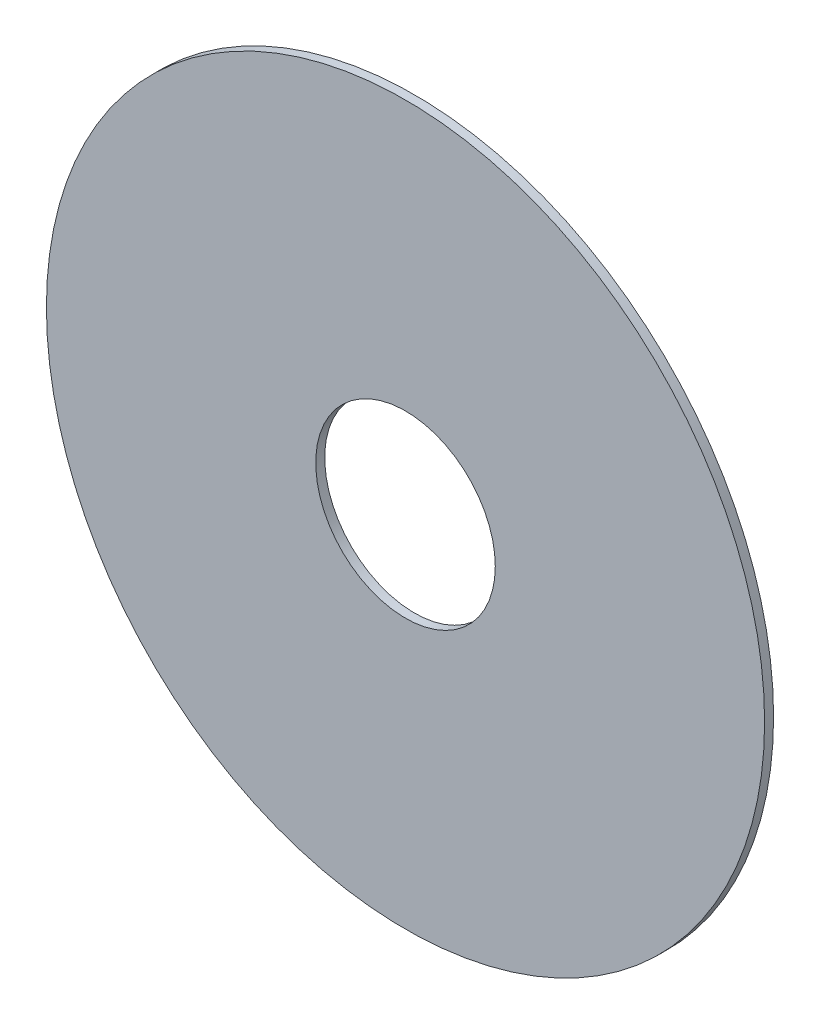
ISO-10303-21;
HEADER;
FILE_DESCRIPTION(('STEP AP214'),'2;1');
FILE_NAME('part.step','',(''),(''),'','','');
FILE_SCHEMA(('AUTOMOTIVE_DESIGN { 1 0 10303 214 1 1 1 1 }'));
ENDSEC;
DATA;
#1=APPLICATION_CONTEXT('core data for automotive mechanical design processes');
#2=APPLICATION_PROTOCOL_DEFINITION('international standard','automotive_design',2000,#1);
#3=PRODUCT_CONTEXT('',#1,'mechanical');
#4=PRODUCT('Part','Part','',(#3));
#5=PRODUCT_RELATED_PRODUCT_CATEGORY('part','',(#4));
#6=PRODUCT_DEFINITION_FORMATION('','',#4);
#7=PRODUCT_DEFINITION_CONTEXT('part definition',#1,'design');
#8=PRODUCT_DEFINITION('design','',#6,#7);
#9=PRODUCT_DEFINITION_SHAPE('','',#8);
#10=(LENGTH_UNIT() NAMED_UNIT(*) SI_UNIT(.MILLI.,.METRE.));
#11=(NAMED_UNIT(*) PLANE_ANGLE_UNIT() SI_UNIT($,.RADIAN.));
#12=(NAMED_UNIT(*) SI_UNIT($,.STERADIAN.) SOLID_ANGLE_UNIT());
#13=UNCERTAINTY_MEASURE_WITH_UNIT(LENGTH_MEASURE(1.E-05),#10,'distance_accuracy_value','');
#14=(GEOMETRIC_REPRESENTATION_CONTEXT(3) GLOBAL_UNCERTAINTY_ASSIGNED_CONTEXT((#13)) GLOBAL_UNIT_ASSIGNED_CONTEXT((#10,
#11,#12)) REPRESENTATION_CONTEXT('',''));
#15=CARTESIAN_POINT('',(0.,0.,0.));
#16=DIRECTION('',(0.,0.,1.));
#17=DIRECTION('',(1.,0.,0.));
#18=AXIS2_PLACEMENT_3D('',#15,#16,#17);
#19=CARTESIAN_POINT('',(0.,0.,0.5));
#20=DIRECTION('',(0.,0.,1.));
#21=DIRECTION('',(1.,0.,0.));
#22=AXIS2_PLACEMENT_3D('',#19,#20,#21);
#23=PLANE('',#22);
#24=CARTESIAN_POINT('',(0.,0.,0.5));
#25=DIRECTION('',(0.,0.,1.));
#26=DIRECTION('',(1.,0.,0.));
#27=AXIS2_PLACEMENT_3D('',#24,#25,#26);
#28=CIRCLE('',#27,5.);
#29=CARTESIAN_POINT('',(5.,0.,0.5));
#30=VERTEX_POINT('',#29);
#31=EDGE_CURVE('E26',#30,#30,#28,.F.);
#32=ORIENTED_EDGE('',*,*,#31,.T.);
#33=EDGE_LOOP('',(#32));
#34=FACE_BOUND('',#33,.T.);
#35=CARTESIAN_POINT('',(0.,0.,0.5));
#36=DIRECTION('',(0.,0.,1.));
#37=DIRECTION('',(1.,0.,0.));
#38=AXIS2_PLACEMENT_3D('',#35,#36,#37);
#39=CIRCLE('',#38,20.);
#40=CARTESIAN_POINT('',(20.,0.,0.5));
#41=VERTEX_POINT('',#40);
#42=EDGE_CURVE('E17',#41,#41,#39,.F.);
#43=ORIENTED_EDGE('',*,*,#42,.F.);
#44=EDGE_LOOP('',(#43));
#45=FACE_BOUND('',#44,.T.);
#46=ADVANCED_FACE('F14',(#34,#45),#23,.T.);
#47=CARTESIAN_POINT('',(0.,0.,0.));
#48=DIRECTION('',(0.,0.,1.));
#49=DIRECTION('',(1.,0.,0.));
#50=AXIS2_PLACEMENT_3D('',#47,#48,#49);
#51=CYLINDRICAL_SURFACE('',#50,20.);
#52=ORIENTED_EDGE('',*,*,#42,.T.);
#53=EDGE_LOOP('',(#52));
#54=FACE_BOUND('',#53,.T.);
#55=CARTESIAN_POINT('',(0.,0.,0.));
#56=DIRECTION('',(0.,0.,1.));
#57=DIRECTION('',(1.,0.,0.));
#58=AXIS2_PLACEMENT_3D('',#55,#56,#57);
#59=CIRCLE('',#58,20.);
#60=CARTESIAN_POINT('',(20.,0.,0.));
#61=VERTEX_POINT('',#60);
#62=EDGE_CURVE('E21',#61,#61,#59,.T.);
#63=ORIENTED_EDGE('',*,*,#62,.T.);
#64=EDGE_LOOP('',(#63));
#65=FACE_BOUND('',#64,.T.);
#66=ADVANCED_FACE('F34',(#54,#65),#51,.T.);
#67=CARTESIAN_POINT('',(0.,0.,0.));
#68=DIRECTION('',(0.,0.,1.));
#69=DIRECTION('',(1.,0.,0.));
#70=AXIS2_PLACEMENT_3D('',#67,#68,#69);
#71=CYLINDRICAL_SURFACE('',#70,5.);
#72=ORIENTED_EDGE('',*,*,#31,.F.);
#73=EDGE_LOOP('',(#72));
#74=FACE_BOUND('',#73,.T.);
#75=CARTESIAN_POINT('',(0.,0.,0.));
#76=DIRECTION('',(0.,0.,1.));
#77=DIRECTION('',(1.,0.,0.));
#78=AXIS2_PLACEMENT_3D('',#75,#76,#77);
#79=CIRCLE('',#78,5.);
#80=CARTESIAN_POINT('',(5.,0.,0.));
#81=VERTEX_POINT('',#80);
#82=EDGE_CURVE('E10',#81,#81,#79,.F.);
#83=ORIENTED_EDGE('',*,*,#82,.T.);
#84=EDGE_LOOP('',(#83));
#85=FACE_BOUND('',#84,.T.);
#86=ADVANCED_FACE('F42',(#74,#85),#71,.F.);
#87=CARTESIAN_POINT('',(0.,0.,0.));
#88=DIRECTION('',(0.,0.,1.));
#89=DIRECTION('',(1.,0.,0.));
#90=AXIS2_PLACEMENT_3D('',#87,#88,#89);
#91=PLANE('',#90);
#92=ORIENTED_EDGE('',*,*,#82,.F.);
#93=EDGE_LOOP('',(#92));
#94=FACE_BOUND('',#93,.T.);
#95=ORIENTED_EDGE('',*,*,#62,.F.);
#96=EDGE_LOOP('',(#95));
#97=FACE_BOUND('',#96,.T.);
#98=ADVANCED_FACE('F43',(#94,#97),#91,.F.);
#99=CLOSED_SHELL('',(#46,#66,#86,#98));
#100=MANIFOLD_SOLID_BREP('B1',#99);
#101=ADVANCED_BREP_SHAPE_REPRESENTATION('',(#18,#100),#14);
#102=SHAPE_DEFINITION_REPRESENTATION(#9,#101);
ENDSEC;
END-ISO-10303-21;
